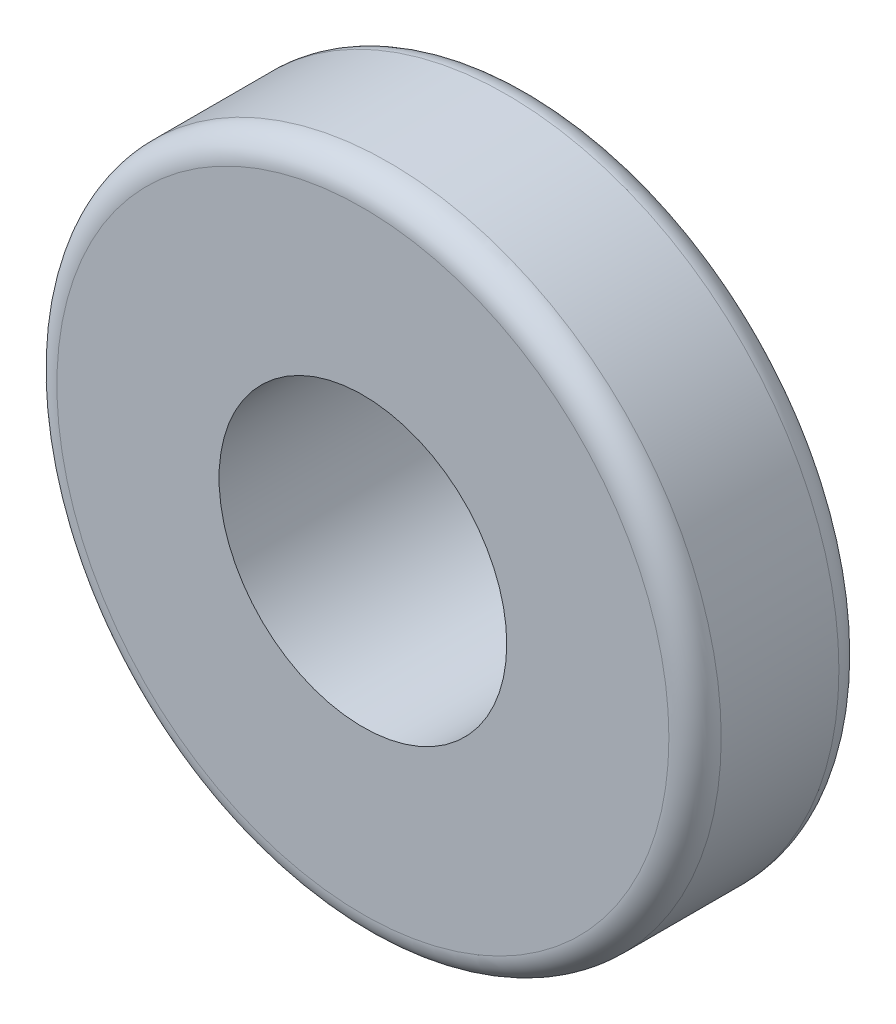
ISO-10303-21;
HEADER;
FILE_DESCRIPTION(('STEP AP214'),'2;1');
FILE_NAME('part.step','',(''),(''),'','','');
FILE_SCHEMA(('AUTOMOTIVE_DESIGN { 1 0 10303 214 1 1 1 1 }'));
ENDSEC;
DATA;
#1=APPLICATION_CONTEXT('core data for automotive mechanical design processes');
#2=APPLICATION_PROTOCOL_DEFINITION('international standard','automotive_design',2000,#1);
#3=PRODUCT_CONTEXT('',#1,'mechanical');
#4=PRODUCT('Part','Part','',(#3));
#5=PRODUCT_RELATED_PRODUCT_CATEGORY('part','',(#4));
#6=PRODUCT_DEFINITION_FORMATION('','',#4);
#7=PRODUCT_DEFINITION_CONTEXT('part definition',#1,'design');
#8=PRODUCT_DEFINITION('design','',#6,#7);
#9=PRODUCT_DEFINITION_SHAPE('','',#8);
#10=(LENGTH_UNIT() NAMED_UNIT(*) SI_UNIT(.MILLI.,.METRE.));
#11=(NAMED_UNIT(*) PLANE_ANGLE_UNIT() SI_UNIT($,.RADIAN.));
#12=(NAMED_UNIT(*) SI_UNIT($,.STERADIAN.) SOLID_ANGLE_UNIT());
#13=UNCERTAINTY_MEASURE_WITH_UNIT(LENGTH_MEASURE(1.E-05),#10,'distance_accuracy_value','');
#14=(GEOMETRIC_REPRESENTATION_CONTEXT(3) GLOBAL_UNCERTAINTY_ASSIGNED_CONTEXT((#13)) GLOBAL_UNIT_ASSIGNED_CONTEXT((#10,
#11,#12)) REPRESENTATION_CONTEXT('',''));
#15=CARTESIAN_POINT('',(0.,0.,0.));
#16=DIRECTION('',(0.,0.,1.));
#17=DIRECTION('',(1.,0.,0.));
#18=AXIS2_PLACEMENT_3D('',#15,#16,#17);
#19=CARTESIAN_POINT('',(0.,0.,-5.5));
#20=DIRECTION('',(0.,0.,1.));
#21=DIRECTION('',(1.,0.,0.));
#22=AXIS2_PLACEMENT_3D('',#19,#20,#21);
#23=PLANE('',#22);
#24=CARTESIAN_POINT('',(0.,0.,-5.5));
#25=DIRECTION('',(0.,0.,1.));
#26=DIRECTION('',(1.,0.,0.));
#27=AXIS2_PLACEMENT_3D('',#24,#25,#26);
#28=CIRCLE('',#27,22.5);
#29=CARTESIAN_POINT('',(22.5,0.,-5.5));
#30=VERTEX_POINT('',#29);
#31=EDGE_CURVE('E11',#30,#30,#28,.T.);
#32=ORIENTED_EDGE('',*,*,#31,.T.);
#33=EDGE_LOOP('',(#32));
#34=FACE_BOUND('',#33,.T.);
#35=CARTESIAN_POINT('',(0.,0.,-5.5));
#36=DIRECTION('',(0.,0.,1.));
#37=DIRECTION('',(1.,0.,0.));
#38=AXIS2_PLACEMENT_3D('',#35,#36,#37);
#39=CIRCLE('',#38,17.5);
#40=CARTESIAN_POINT('',(17.5,0.,-5.5));
#41=VERTEX_POINT('',#40);
#42=EDGE_CURVE('E51',#41,#41,#39,.T.);
#43=ORIENTED_EDGE('',*,*,#42,.F.);
#44=EDGE_LOOP('',(#43));
#45=FACE_BOUND('',#44,.T.);
#46=ADVANCED_FACE('F40',(#34,#45),#23,.T.);
#47=CARTESIAN_POINT('',(0.,0.,-20.));
#48=DIRECTION('',(0.,0.,1.));
#49=DIRECTION('',(1.,0.,0.));
#50=AXIS2_PLACEMENT_3D('',#47,#48,#49);
#51=PLANE('',#50);
#52=CARTESIAN_POINT('',(0.,0.,-20.));
#53=DIRECTION('',(0.,0.,1.));
#54=DIRECTION('',(1.,0.,0.));
#55=AXIS2_PLACEMENT_3D('',#52,#53,#54);
#56=CIRCLE('',#55,22.5);
#57=CARTESIAN_POINT('',(22.5,0.,-20.));
#58=VERTEX_POINT('',#57);
#59=EDGE_CURVE('E44',#58,#58,#56,.T.);
#60=ORIENTED_EDGE('',*,*,#59,.F.);
#61=EDGE_LOOP('',(#60));
#62=FACE_BOUND('',#61,.T.);
#63=CARTESIAN_POINT('',(0.,0.,-20.));
#64=DIRECTION('',(0.,0.,1.));
#65=DIRECTION('',(1.,0.,0.));
#66=AXIS2_PLACEMENT_3D('',#63,#64,#65);
#67=CIRCLE('',#66,17.5);
#68=CARTESIAN_POINT('',(17.5,0.,-20.));
#69=VERTEX_POINT('',#68);
#70=EDGE_CURVE('E53',#69,#69,#67,.T.);
#71=ORIENTED_EDGE('',*,*,#70,.T.);
#72=EDGE_LOOP('',(#71));
#73=FACE_BOUND('',#72,.T.);
#74=ADVANCED_FACE('F63',(#62,#73),#51,.F.);
#75=CARTESIAN_POINT('',(0.,0.,-5.5));
#76=DIRECTION('',(0.,0.,-1.));
#77=DIRECTION('',(-1.,0.,0.));
#78=AXIS2_PLACEMENT_3D('',#75,#76,#77);
#79=CYLINDRICAL_SURFACE('',#78,22.5);
#80=ORIENTED_EDGE('',*,*,#31,.F.);
#81=EDGE_LOOP('',(#80));
#82=FACE_BOUND('',#81,.T.);
#83=ORIENTED_EDGE('',*,*,#59,.T.);
#84=EDGE_LOOP('',(#83));
#85=FACE_BOUND('',#84,.T.);
#86=ADVANCED_FACE('F42',(#82,#85),#79,.T.);
#87=CARTESIAN_POINT('',(0.,0.,-5.5));
#88=DIRECTION('',(0.,0.,-1.));
#89=DIRECTION('',(-1.,0.,0.));
#90=AXIS2_PLACEMENT_3D('',#87,#88,#89);
#91=CYLINDRICAL_SURFACE('',#90,17.5);
#92=ORIENTED_EDGE('',*,*,#42,.T.);
#93=EDGE_LOOP('',(#92));
#94=FACE_BOUND('',#93,.T.);
#95=ORIENTED_EDGE('',*,*,#70,.F.);
#96=EDGE_LOOP('',(#95));
#97=FACE_BOUND('',#96,.T.);
#98=ADVANCED_FACE('F59',(#94,#97),#91,.F.);
#99=CLOSED_SHELL('',(#46,#74,#86,#98));
#100=MANIFOLD_SOLID_BREP('B2',#99);
#101=CARTESIAN_POINT('',(0.,0.,65.));
#102=DIRECTION('',(0.,0.,-1.));
#103=DIRECTION('',(-1.,0.,0.));
#104=AXIS2_PLACEMENT_3D('',#101,#102,#103);
#105=CYLINDRICAL_SURFACE('',#104,127.);
#106=CARTESIAN_POINT('',(0.,0.,10.));
#107=DIRECTION('',(0.,0.,1.));
#108=DIRECTION('',(1.,0.,0.));
#109=AXIS2_PLACEMENT_3D('',#106,#107,#108);
#110=CIRCLE('',#109,127.);
#111=CARTESIAN_POINT('',(127.,0.,10.));
#112=VERTEX_POINT('',#111);
#113=EDGE_CURVE('E124',#112,#112,#110,.T.);
#114=ORIENTED_EDGE('',*,*,#113,.T.);
#115=EDGE_LOOP('',(#114));
#116=FACE_BOUND('',#115,.T.);
#117=CARTESIAN_POINT('',(0.,0.,55.));
#118=DIRECTION('',(0.,0.,1.));
#119=DIRECTION('',(1.,0.,0.));
#120=AXIS2_PLACEMENT_3D('',#117,#118,#119);
#121=CIRCLE('',#120,127.);
#122=CARTESIAN_POINT('',(127.,0.,55.));
#123=VERTEX_POINT('',#122);
#124=EDGE_CURVE('E127',#123,#123,#121,.F.);
#125=ORIENTED_EDGE('',*,*,#124,.T.);
#126=EDGE_LOOP('',(#125));
#127=FACE_BOUND('',#126,.T.);
#128=ADVANCED_FACE('F101',(#116,#127),#105,.T.);
#129=CARTESIAN_POINT('',(0.,0.,65.));
#130=DIRECTION('',(0.,0.,1.));
#131=DIRECTION('',(1.,0.,0.));
#132=AXIS2_PLACEMENT_3D('',#129,#130,#131);
#133=PLANE('',#132);
#134=CARTESIAN_POINT('',(0.,0.,65.));
#135=DIRECTION('',(0.,0.,1.));
#136=DIRECTION('',(1.,0.,0.));
#137=AXIS2_PLACEMENT_3D('',#134,#135,#136);
#138=CIRCLE('',#137,55.);
#139=CARTESIAN_POINT('',(55.,0.,65.));
#140=VERTEX_POINT('',#139);
#141=EDGE_CURVE('E131',#140,#140,#138,.T.);
#142=ORIENTED_EDGE('',*,*,#141,.F.);
#143=EDGE_LOOP('',(#142));
#144=FACE_BOUND('',#143,.T.);
#145=CARTESIAN_POINT('',(0.,0.,65.));
#146=DIRECTION('',(0.,0.,1.));
#147=DIRECTION('',(1.,0.,0.));
#148=AXIS2_PLACEMENT_3D('',#145,#146,#147);
#149=CIRCLE('',#148,117.);
#150=CARTESIAN_POINT('',(117.,0.,65.));
#151=VERTEX_POINT('',#150);
#152=EDGE_CURVE('E116',#151,#151,#149,.T.);
#153=ORIENTED_EDGE('',*,*,#152,.T.);
#154=EDGE_LOOP('',(#153));
#155=FACE_BOUND('',#154,.T.);
#156=ADVANCED_FACE('F145',(#144,#155),#133,.T.);
#157=CARTESIAN_POINT('',(0.,0.,0.));
#158=DIRECTION('',(0.,0.,1.));
#159=DIRECTION('',(1.,0.,0.));
#160=AXIS2_PLACEMENT_3D('',#157,#158,#159);
#161=PLANE('',#160);
#162=CARTESIAN_POINT('',(0.,0.,0.));
#163=DIRECTION('',(0.,0.,1.));
#164=DIRECTION('',(1.,0.,0.));
#165=AXIS2_PLACEMENT_3D('',#162,#163,#164);
#166=CIRCLE('',#165,67.5);
#167=CARTESIAN_POINT('',(67.5,0.,0.));
#168=VERTEX_POINT('',#167);
#169=EDGE_CURVE('E112',#168,#168,#166,.F.);
#170=ORIENTED_EDGE('',*,*,#169,.F.);
#171=EDGE_LOOP('',(#170));
#172=FACE_BOUND('',#171,.T.);
#173=CARTESIAN_POINT('',(0.,0.,0.));
#174=DIRECTION('',(0.,0.,1.));
#175=DIRECTION('',(1.,0.,0.));
#176=AXIS2_PLACEMENT_3D('',#173,#174,#175);
#177=CIRCLE('',#176,117.);
#178=CARTESIAN_POINT('',(117.,0.,0.));
#179=VERTEX_POINT('',#178);
#180=EDGE_CURVE('E121',#179,#179,#177,.F.);
#181=ORIENTED_EDGE('',*,*,#180,.T.);
#182=EDGE_LOOP('',(#181));
#183=FACE_BOUND('',#182,.T.);
#184=ADVANCED_FACE('F148',(#172,#183),#161,.F.);
#185=CARTESIAN_POINT('',(0.,0.,10.));
#186=DIRECTION('',(0.,0.,1.));
#187=DIRECTION('',(1.,0.,0.));
#188=AXIS2_PLACEMENT_3D('',#185,#186,#187);
#189=TOROIDAL_SURFACE('',#188,117.,10.);
#190=ORIENTED_EDGE('',*,*,#180,.F.);
#191=EDGE_LOOP('',(#190));
#192=FACE_BOUND('',#191,.T.);
#193=ORIENTED_EDGE('',*,*,#113,.F.);
#194=EDGE_LOOP('',(#193));
#195=FACE_BOUND('',#194,.T.);
#196=ADVANCED_FACE('F155',(#192,#195),#189,.T.);
#197=CARTESIAN_POINT('',(0.,0.,55.));
#198=DIRECTION('',(0.,0.,1.));
#199=DIRECTION('',(1.,0.,0.));
#200=AXIS2_PLACEMENT_3D('',#197,#198,#199);
#201=TOROIDAL_SURFACE('',#200,117.,10.);
#202=ORIENTED_EDGE('',*,*,#124,.F.);
#203=EDGE_LOOP('',(#202));
#204=FACE_BOUND('',#203,.T.);
#205=ORIENTED_EDGE('',*,*,#152,.F.);
#206=EDGE_LOOP('',(#205));
#207=FACE_BOUND('',#206,.T.);
#208=ADVANCED_FACE('F152',(#204,#207),#201,.T.);
#209=CARTESIAN_POINT('',(0.,0.,-35.));
#210=DIRECTION('',(0.,0.,1.));
#211=DIRECTION('',(1.,0.,0.));
#212=AXIS2_PLACEMENT_3D('',#209,#210,#211);
#213=CYLINDRICAL_SURFACE('',#212,67.5);
#214=CARTESIAN_POINT('',(0.,0.,-25.));
#215=DIRECTION('',(0.,0.,-1.));
#216=DIRECTION('',(-1.,0.,0.));
#217=AXIS2_PLACEMENT_3D('',#214,#215,#216);
#218=CIRCLE('',#217,67.5);
#219=CARTESIAN_POINT('',(-67.5,0.,-25.));
#220=VERTEX_POINT('',#219);
#221=EDGE_CURVE('E39',#220,#220,#218,.F.);
#222=ORIENTED_EDGE('',*,*,#221,.T.);
#223=EDGE_LOOP('',(#222));
#224=FACE_BOUND('',#223,.T.);
#225=ORIENTED_EDGE('',*,*,#169,.T.);
#226=EDGE_LOOP('',(#225));
#227=FACE_BOUND('',#226,.T.);
#228=ADVANCED_FACE('F154',(#224,#227),#213,.T.);
#229=CARTESIAN_POINT('',(0.,0.,-35.));
#230=DIRECTION('',(0.,0.,-1.));
#231=DIRECTION('',(-1.,0.,0.));
#232=AXIS2_PLACEMENT_3D('',#229,#230,#231);
#233=PLANE('',#232);
#234=CARTESIAN_POINT('',(0.,0.,-35.));
#235=DIRECTION('',(0.,0.,-1.));
#236=DIRECTION('',(-1.,0.,0.));
#237=AXIS2_PLACEMENT_3D('',#234,#235,#236);
#238=CIRCLE('',#237,57.5);
#239=CARTESIAN_POINT('',(-57.5,0.,-35.));
#240=VERTEX_POINT('',#239);
#241=EDGE_CURVE('E108',#240,#240,#238,.T.);
#242=ORIENTED_EDGE('',*,*,#241,.T.);
#243=EDGE_LOOP('',(#242));
#244=FACE_BOUND('',#243,.T.);
#245=ADVANCED_FACE('F161',(#244),#233,.T.);
#246=CARTESIAN_POINT('',(0.,0.,-25.));
#247=DIRECTION('',(0.,0.,-1.));
#248=DIRECTION('',(-1.,0.,0.));
#249=AXIS2_PLACEMENT_3D('',#246,#247,#248);
#250=TOROIDAL_SURFACE('',#249,57.5,10.);
#251=ORIENTED_EDGE('',*,*,#221,.F.);
#252=EDGE_LOOP('',(#251));
#253=FACE_BOUND('',#252,.T.);
#254=ORIENTED_EDGE('',*,*,#241,.F.);
#255=EDGE_LOOP('',(#254));
#256=FACE_BOUND('',#255,.T.);
#257=ADVANCED_FACE('F103',(#253,#256),#250,.T.);
#258=CARTESIAN_POINT('',(0.,0.,-20.));
#259=DIRECTION('',(0.,0.,1.));
#260=DIRECTION('',(1.,0.,0.));
#261=AXIS2_PLACEMENT_3D('',#258,#259,#260);
#262=CYLINDRICAL_SURFACE('',#261,55.);
#263=CARTESIAN_POINT('',(0.,0.,-20.));
#264=DIRECTION('',(0.,0.,1.));
#265=DIRECTION('',(1.,0.,0.));
#266=AXIS2_PLACEMENT_3D('',#263,#264,#265);
#267=CIRCLE('',#266,55.);
#268=CARTESIAN_POINT('',(55.,0.,-20.));
#269=VERTEX_POINT('',#268);
#270=EDGE_CURVE('E130',#269,#269,#267,.T.);
#271=ORIENTED_EDGE('',*,*,#270,.F.);
#272=EDGE_LOOP('',(#271));
#273=FACE_BOUND('',#272,.T.);
#274=ORIENTED_EDGE('',*,*,#141,.T.);
#275=EDGE_LOOP('',(#274));
#276=FACE_BOUND('',#275,.T.);
#277=ADVANCED_FACE('F139',(#273,#276),#262,.F.);
#278=CARTESIAN_POINT('',(0.,0.,-20.));
#279=DIRECTION('',(0.,0.,1.));
#280=DIRECTION('',(1.,0.,0.));
#281=AXIS2_PLACEMENT_3D('',#278,#279,#280);
#282=PLANE('',#281);
#283=ORIENTED_EDGE('',*,*,#270,.T.);
#284=EDGE_LOOP('',(#283));
#285=FACE_BOUND('',#284,.T.);
#286=ADVANCED_FACE('F137',(#285),#282,.T.);
#287=CLOSED_SHELL('',(#128,#156,#184,#196,#208,#228,#245,#257,#277,#286));
#288=MANIFOLD_SOLID_BREP('B6',#287);
#289=ADVANCED_BREP_SHAPE_REPRESENTATION('',(#18,#100,#288),#14);
#290=SHAPE_DEFINITION_REPRESENTATION(#9,#289);
ENDSEC;
END-ISO-10303-21;
